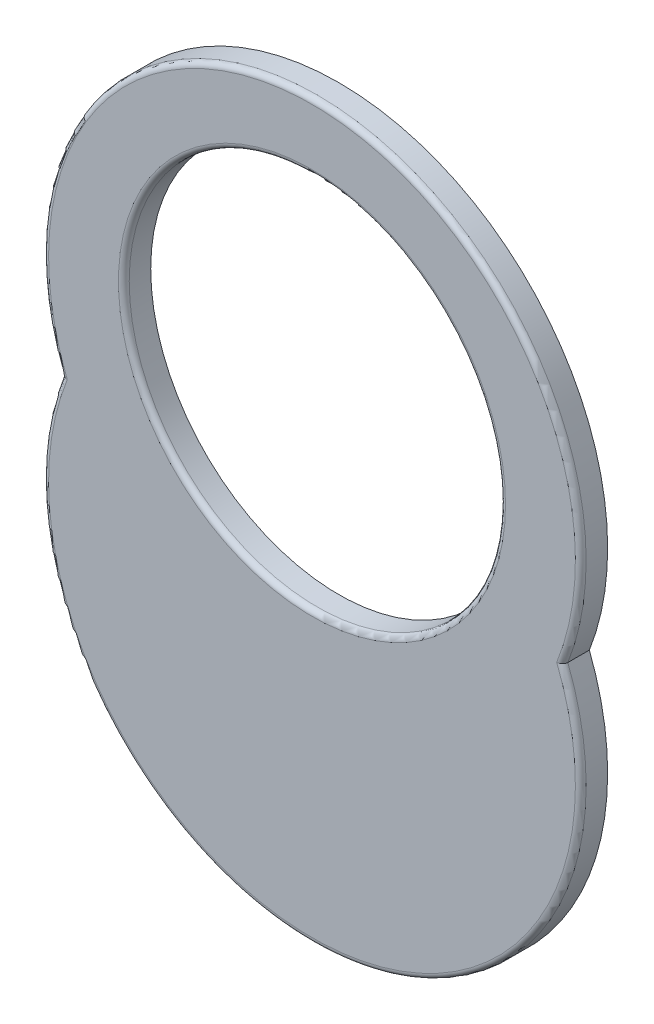
ISO-10303-21;
HEADER;
FILE_DESCRIPTION(('STEP AP214'),'2;1');
FILE_NAME('part.step','',(''),(''),'','','');
FILE_SCHEMA(('AUTOMOTIVE_DESIGN { 1 0 10303 214 1 1 1 1 }'));
ENDSEC;
DATA;
#1=APPLICATION_CONTEXT('core data for automotive mechanical design processes');
#2=APPLICATION_PROTOCOL_DEFINITION('international standard','automotive_design',2000,#1);
#3=PRODUCT_CONTEXT('',#1,'mechanical');
#4=PRODUCT('Part','Part','',(#3));
#5=PRODUCT_RELATED_PRODUCT_CATEGORY('part','',(#4));
#6=PRODUCT_DEFINITION_FORMATION('','',#4);
#7=PRODUCT_DEFINITION_CONTEXT('part definition',#1,'design');
#8=PRODUCT_DEFINITION('design','',#6,#7);
#9=PRODUCT_DEFINITION_SHAPE('','',#8);
#10=(LENGTH_UNIT() NAMED_UNIT(*) SI_UNIT(.MILLI.,.METRE.));
#11=(NAMED_UNIT(*) PLANE_ANGLE_UNIT() SI_UNIT($,.RADIAN.));
#12=(NAMED_UNIT(*) SI_UNIT($,.STERADIAN.) SOLID_ANGLE_UNIT());
#13=UNCERTAINTY_MEASURE_WITH_UNIT(LENGTH_MEASURE(1.E-05),#10,'distance_accuracy_value','');
#14=(GEOMETRIC_REPRESENTATION_CONTEXT(3) GLOBAL_UNCERTAINTY_ASSIGNED_CONTEXT((#13)) GLOBAL_UNIT_ASSIGNED_CONTEXT((#10,
#11,#12)) REPRESENTATION_CONTEXT('',''));
#15=CARTESIAN_POINT('',(0.,0.,0.));
#16=DIRECTION('',(0.,0.,1.));
#17=DIRECTION('',(1.,0.,0.));
#18=AXIS2_PLACEMENT_3D('',#15,#16,#17);
#19=CARTESIAN_POINT('',(0.,7.25,2.));
#20=DIRECTION('',(0.,0.,1.));
#21=DIRECTION('',(1.,0.,0.));
#22=AXIS2_PLACEMENT_3D('',#19,#20,#21);
#23=PLANE('',#22);
#24=CARTESIAN_POINT('',(0.,15.5,2.));
#25=DIRECTION('',(0.,0.,1.));
#26=DIRECTION('',(1.,0.,0.));
#27=AXIS2_PLACEMENT_3D('',#24,#25,#26);
#28=CIRCLE('',#27,14.4);
#29=CARTESIAN_POINT('',(14.4,15.5,2.));
#30=VERTEX_POINT('',#29);
#31=EDGE_CURVE('E115',#30,#30,#28,.F.);
#32=ORIENTED_EDGE('',*,*,#31,.T.);
#33=EDGE_LOOP('',(#32));
#34=FACE_BOUND('',#33,.T.);
#35=CARTESIAN_POINT('',(0.,14.5,2.));
#36=DIRECTION('',(0.,0.,1.));
#37=DIRECTION('',(1.,0.,0.));
#38=AXIS2_PLACEMENT_3D('',#35,#36,#37);
#39=CIRCLE('',#38,19.6);
#40=CARTESIAN_POINT('',(18.2098187799879,7.25,2.));
#41=VERTEX_POINT('',#40);
#42=CARTESIAN_POINT('',(-18.2098187799879,7.25,2.));
#43=VERTEX_POINT('',#42);
#44=EDGE_CURVE('E110',#41,#43,#39,.T.);
#45=ORIENTED_EDGE('',*,*,#44,.T.);
#46=CARTESIAN_POINT('',(0.,0.,2.));
#47=DIRECTION('',(0.,0.,1.));
#48=DIRECTION('',(1.,0.,0.));
#49=AXIS2_PLACEMENT_3D('',#46,#47,#48);
#50=CIRCLE('',#49,19.6);
#51=EDGE_CURVE('E112',#43,#41,#50,.T.);
#52=ORIENTED_EDGE('',*,*,#51,.T.);
#53=EDGE_LOOP('',(#45,#52));
#54=FACE_BOUND('',#53,.T.);
#55=ADVANCED_FACE('F46',(#34,#54),#23,.T.);
#56=CARTESIAN_POINT('',(0.,7.25,0.));
#57=DIRECTION('',(0.,0.,1.));
#58=DIRECTION('',(1.,0.,0.));
#59=AXIS2_PLACEMENT_3D('',#56,#57,#58);
#60=PLANE('',#59);
#61=CARTESIAN_POINT('',(0.,14.5,0.));
#62=DIRECTION('',(0.,0.,1.));
#63=DIRECTION('',(1.,0.,0.));
#64=AXIS2_PLACEMENT_3D('',#61,#62,#63);
#65=CIRCLE('',#64,20.);
#66=CARTESIAN_POINT('',(18.6396754263587,7.25,0.));
#67=VERTEX_POINT('',#66);
#68=CARTESIAN_POINT('',(-18.6396754263587,7.25,0.));
#69=VERTEX_POINT('',#68);
#70=EDGE_CURVE('E99',#67,#69,#65,.T.);
#71=ORIENTED_EDGE('',*,*,#70,.F.);
#72=CARTESIAN_POINT('',(0.,0.,0.));
#73=DIRECTION('',(0.,0.,1.));
#74=DIRECTION('',(1.,0.,0.));
#75=AXIS2_PLACEMENT_3D('',#72,#73,#74);
#76=CIRCLE('',#75,20.);
#77=EDGE_CURVE('E90',#69,#67,#76,.T.);
#78=ORIENTED_EDGE('',*,*,#77,.F.);
#79=EDGE_LOOP('',(#71,#78));
#80=FACE_BOUND('',#79,.T.);
#81=CARTESIAN_POINT('',(0.,15.5,0.));
#82=DIRECTION('',(0.,0.,1.));
#83=DIRECTION('',(1.,0.,0.));
#84=AXIS2_PLACEMENT_3D('',#81,#82,#83);
#85=CIRCLE('',#84,14.);
#86=CARTESIAN_POINT('',(14.,15.5,0.));
#87=VERTEX_POINT('',#86);
#88=EDGE_CURVE('E102',#87,#87,#85,.T.);
#89=ORIENTED_EDGE('',*,*,#88,.T.);
#90=EDGE_LOOP('',(#89));
#91=FACE_BOUND('',#90,.T.);
#92=ADVANCED_FACE('F97',(#80,#91),#60,.F.);
#93=CARTESIAN_POINT('',(0.,14.5,2.));
#94=DIRECTION('',(0.,0.,-1.));
#95=DIRECTION('',(-1.,0.,0.));
#96=AXIS2_PLACEMENT_3D('',#93,#94,#95);
#97=CYLINDRICAL_SURFACE('',#96,20.);
#98=DIRECTION('',(0.,0.,-1.));
#99=VECTOR('',#98,1.);
#100=CARTESIAN_POINT('',(-18.6396754263587,7.25,2.));
#101=LINE('',#100,#99);
#102=CARTESIAN_POINT('',(-18.6396754263587,7.25,1.6));
#103=VERTEX_POINT('',#102);
#104=EDGE_CURVE('E87',#103,#69,#101,.T.);
#105=ORIENTED_EDGE('',*,*,#104,.F.);
#106=CARTESIAN_POINT('',(0.,14.5,1.6));
#107=DIRECTION('',(0.,0.,1.));
#108=DIRECTION('',(1.,0.,0.));
#109=AXIS2_PLACEMENT_3D('',#106,#107,#108);
#110=CIRCLE('',#109,20.);
#111=CARTESIAN_POINT('',(18.6396754263587,7.25,1.6));
#112=VERTEX_POINT('',#111);
#113=EDGE_CURVE('E13',#103,#112,#110,.F.);
#114=ORIENTED_EDGE('',*,*,#113,.T.);
#115=DIRECTION('',(0.,0.,-1.));
#116=VECTOR('',#115,1.);
#117=CARTESIAN_POINT('',(18.6396754263587,7.25,2.));
#118=LINE('',#117,#116);
#119=EDGE_CURVE('E94',#112,#67,#118,.T.);
#120=ORIENTED_EDGE('',*,*,#119,.T.);
#121=ORIENTED_EDGE('',*,*,#70,.T.);
#122=EDGE_LOOP('',(#105,#114,#120,#121));
#123=FACE_BOUND('',#122,.T.);
#124=ADVANCED_FACE('F101',(#123),#97,.T.);
#125=CARTESIAN_POINT('',(0.,0.,2.));
#126=DIRECTION('',(0.,0.,-1.));
#127=DIRECTION('',(-1.,0.,0.));
#128=AXIS2_PLACEMENT_3D('',#125,#126,#127);
#129=CYLINDRICAL_SURFACE('',#128,20.);
#130=ORIENTED_EDGE('',*,*,#119,.F.);
#131=CARTESIAN_POINT('',(0.,0.,1.6));
#132=DIRECTION('',(0.,0.,1.));
#133=DIRECTION('',(1.,0.,0.));
#134=AXIS2_PLACEMENT_3D('',#131,#132,#133);
#135=CIRCLE('',#134,20.);
#136=EDGE_CURVE('E60',#112,#103,#135,.F.);
#137=ORIENTED_EDGE('',*,*,#136,.T.);
#138=ORIENTED_EDGE('',*,*,#104,.T.);
#139=ORIENTED_EDGE('',*,*,#77,.T.);
#140=EDGE_LOOP('',(#130,#137,#138,#139));
#141=FACE_BOUND('',#140,.T.);
#142=ADVANCED_FACE('F89',(#141),#129,.T.);
#143=CARTESIAN_POINT('',(0.,15.5,2.));
#144=DIRECTION('',(0.,0.,-1.));
#145=DIRECTION('',(-1.,0.,0.));
#146=AXIS2_PLACEMENT_3D('',#143,#144,#145);
#147=CYLINDRICAL_SURFACE('',#146,14.);
#148=CARTESIAN_POINT('',(0.,15.5,1.6));
#149=DIRECTION('',(0.,0.,1.));
#150=DIRECTION('',(1.,0.,0.));
#151=AXIS2_PLACEMENT_3D('',#148,#149,#150);
#152=CIRCLE('',#151,14.);
#153=CARTESIAN_POINT('',(14.,15.5,1.6));
#154=VERTEX_POINT('',#153);
#155=EDGE_CURVE('E93',#154,#154,#152,.T.);
#156=ORIENTED_EDGE('',*,*,#155,.T.);
#157=EDGE_LOOP('',(#156));
#158=FACE_BOUND('',#157,.T.);
#159=ORIENTED_EDGE('',*,*,#88,.F.);
#160=EDGE_LOOP('',(#159));
#161=FACE_BOUND('',#160,.T.);
#162=ADVANCED_FACE('F132',(#158,#161),#147,.F.);
#163=CARTESIAN_POINT('',(0.,15.5,1.6));
#164=DIRECTION('',(0.,0.,1.));
#165=DIRECTION('',(1.,0.,0.));
#166=AXIS2_PLACEMENT_3D('',#163,#164,#165);
#167=TOROIDAL_SURFACE('',#166,14.4,0.4);
#168=ORIENTED_EDGE('',*,*,#31,.F.);
#169=EDGE_LOOP('',(#168));
#170=FACE_BOUND('',#169,.T.);
#171=ORIENTED_EDGE('',*,*,#155,.F.);
#172=EDGE_LOOP('',(#171));
#173=FACE_BOUND('',#172,.T.);
#174=ADVANCED_FACE('F127',(#170,#173),#167,.T.);
#175=CARTESIAN_POINT('',(0.,14.5,1.6));
#176=DIRECTION('',(0.,0.,1.));
#177=DIRECTION('',(1.,0.,0.));
#178=AXIS2_PLACEMENT_3D('',#175,#176,#177);
#179=TOROIDAL_SURFACE('',#178,19.6,0.4);
#180=CARTESIAN_POINT('',(18.6396754263587,7.25,1.6));
#181=CARTESIAN_POINT('',(18.6397005281012,7.25,1.62139590931824));
#182=CARTESIAN_POINT('',(18.6378351807503,7.25,1.64277737802263));
#183=CARTESIAN_POINT('',(18.6305193025822,7.25,1.68486346973874));
#184=CARTESIAN_POINT('',(18.6250780113697,7.25,1.70556969312863));
#185=CARTESIAN_POINT('',(18.6108054382317,7.25,1.74576993605286));
#186=CARTESIAN_POINT('',(18.6019747676785,7.25,1.76526417346743));
#187=CARTESIAN_POINT('',(18.5812531528758,7.25,1.8025522667926));
#188=CARTESIAN_POINT('',(18.5693612779441,7.25,1.82034560332709));
#189=CARTESIAN_POINT('',(18.5425450993953,7.25,1.85428722053757));
#190=CARTESIAN_POINT('',(18.5275457314003,7.25,1.87037606904289));
#191=CARTESIAN_POINT('',(18.4952041686046,7.25,1.89999476689));
#192=CARTESIAN_POINT('',(18.4778611919338,7.25,1.91352375858655));
#193=CARTESIAN_POINT('',(18.4401396716824,7.25,1.93856634885764));
#194=CARTESIAN_POINT('',(18.4196374303049,7.25000000000001,1.94989341175779));
#195=CARTESIAN_POINT('',(18.3771063267686,7.25,1.96918667836271));
#196=CARTESIAN_POINT('',(18.3550771415373,7.24999999999999,1.97715216827961));
#197=CARTESIAN_POINT('',(18.3133726687216,7.25,1.98869594811923));
#198=CARTESIAN_POINT('',(18.2938253958821,7.25000000000001,1.99274603798238));
#199=CARTESIAN_POINT('',(18.2543968361814,7.25,1.99827947975032));
#200=CARTESIAN_POINT('',(18.2345162605688,7.24999999999997,1.99976773165328));
#201=CARTESIAN_POINT('',(18.2130352270062,7.24999999999999,1.99999164651654));
#202=CARTESIAN_POINT('',(18.2114269264642,7.25,2.0000000203472));
#203=CARTESIAN_POINT('',(18.2098187799879,7.25,2.));
#204=B_SPLINE_CURVE_WITH_KNOTS('',3,(#180,#181,#182,#183,#184,#185,#186,#187,#188,#189,#190,
#191,#192,#193,#194,#195,#196,#197,#198,#199,#200,#201,#202,#203),.UNSPECIFIED.,.F.,.F.,(4,2,2,
2,2,2,2,2,2,2,2,4),(0.,0.0640842415926781,0.128003548464079,0.191911331056274,0.255838566195051,
0.321541721670062,0.387266851266815,0.457235774217927,0.527219546726207,0.5869495895601,
0.646565259954564,0.651390124609067),.UNSPECIFIED.);
#205=EDGE_CURVE('E118',#112,#41,#204,.T.);
#206=ORIENTED_EDGE('',*,*,#205,.F.);
#207=ORIENTED_EDGE('',*,*,#113,.F.);
#208=CARTESIAN_POINT('',(-18.6396754263587,7.25,1.6));
#209=CARTESIAN_POINT('',(-18.6397005281012,7.25,1.62139590931824));
#210=CARTESIAN_POINT('',(-18.6378351807503,7.25,1.64277737802263));
#211=CARTESIAN_POINT('',(-18.6305193025822,7.25,1.68486346973874));
#212=CARTESIAN_POINT('',(-18.6250780113697,7.25,1.70556969312863));
#213=CARTESIAN_POINT('',(-18.6108054382317,7.25,1.74576993605286));
#214=CARTESIAN_POINT('',(-18.6019747676785,7.25,1.76526417346743));
#215=CARTESIAN_POINT('',(-18.5812531528758,7.25,1.8025522667926));
#216=CARTESIAN_POINT('',(-18.5693612779441,7.25,1.82034560332709));
#217=CARTESIAN_POINT('',(-18.5425450993953,7.25,1.85428722053757));
#218=CARTESIAN_POINT('',(-18.5275457314003,7.25,1.87037606904289));
#219=CARTESIAN_POINT('',(-18.4952041686046,7.25,1.89999476689));
#220=CARTESIAN_POINT('',(-18.4778611919338,7.25,1.91352375858655));
#221=CARTESIAN_POINT('',(-18.4401396716824,7.25,1.93856634885764));
#222=CARTESIAN_POINT('',(-18.4196374303049,7.25,1.94989341175779));
#223=CARTESIAN_POINT('',(-18.3771063267686,7.25,1.96918667836271));
#224=CARTESIAN_POINT('',(-18.3550771415373,7.24999999999999,1.97715216827961));
#225=CARTESIAN_POINT('',(-18.3133726687216,7.25,1.98869594811923));
#226=CARTESIAN_POINT('',(-18.2938253958821,7.25000000000001,1.99274603798238));
#227=CARTESIAN_POINT('',(-18.2543968361814,7.24999999999999,1.99827947975032));
#228=CARTESIAN_POINT('',(-18.2345162605688,7.24999999999996,1.99976773165328));
#229=CARTESIAN_POINT('',(-18.2130352270062,7.25,1.99999164651654));
#230=CARTESIAN_POINT('',(-18.2114269264642,7.25,2.0000000203472));
#231=CARTESIAN_POINT('',(-18.2098187799879,7.25,2.));
#232=B_SPLINE_CURVE_WITH_KNOTS('',3,(#208,#209,#210,#211,#212,#213,#214,#215,#216,#217,#218,
#219,#220,#221,#222,#223,#224,#225,#226,#227,#228,#229,#230,#231),.UNSPECIFIED.,.F.,.F.,(4,2,2,
2,2,2,2,2,2,2,2,4),(0.,0.0640842415926786,0.128003548464079,0.191911331056273,0.255838566195051,
0.321541721670061,0.387266851266814,0.457235774217926,0.527219546726206,0.586949589560096,
0.646565259954563,0.651390124609066),.UNSPECIFIED.);
#233=EDGE_CURVE('E51',#43,#103,#232,.F.);
#234=ORIENTED_EDGE('',*,*,#233,.F.);
#235=ORIENTED_EDGE('',*,*,#44,.F.);
#236=EDGE_LOOP('',(#206,#207,#234,#235));
#237=FACE_BOUND('',#236,.T.);
#238=ADVANCED_FACE('F123',(#237),#179,.T.);
#239=CARTESIAN_POINT('',(0.,0.,1.6));
#240=DIRECTION('',(0.,0.,1.));
#241=DIRECTION('',(1.,0.,0.));
#242=AXIS2_PLACEMENT_3D('',#239,#240,#241);
#243=TOROIDAL_SURFACE('',#242,19.6,0.4);
#244=ORIENTED_EDGE('',*,*,#233,.T.);
#245=ORIENTED_EDGE('',*,*,#136,.F.);
#246=ORIENTED_EDGE('',*,*,#205,.T.);
#247=ORIENTED_EDGE('',*,*,#51,.F.);
#248=EDGE_LOOP('',(#244,#245,#246,#247));
#249=FACE_BOUND('',#248,.T.);
#250=ADVANCED_FACE('F48',(#249),#243,.T.);
#251=CLOSED_SHELL('',(#55,#92,#124,#142,#162,#174,#238,#250));
#252=MANIFOLD_SOLID_BREP('B2',#251);
#253=ADVANCED_BREP_SHAPE_REPRESENTATION('',(#18,#252),#14);
#254=SHAPE_DEFINITION_REPRESENTATION(#9,#253);
ENDSEC;
END-ISO-10303-21;
